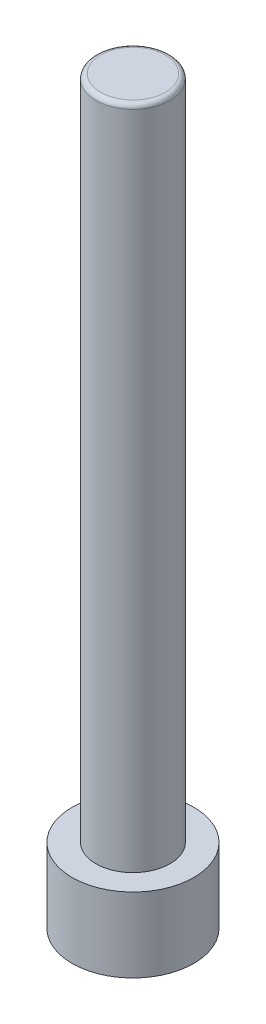
ISO-10303-21;
HEADER;
FILE_DESCRIPTION(('STEP AP214'),'2;1');
FILE_NAME('part.step','',(''),(''),'','','');
FILE_SCHEMA(('AUTOMOTIVE_DESIGN { 1 0 10303 214 1 1 1 1 }'));
ENDSEC;
DATA;
#1=APPLICATION_CONTEXT('core data for automotive mechanical design processes');
#2=APPLICATION_PROTOCOL_DEFINITION('international standard','automotive_design',2000,#1);
#3=PRODUCT_CONTEXT('',#1,'mechanical');
#4=PRODUCT('Part','Part','',(#3));
#5=PRODUCT_RELATED_PRODUCT_CATEGORY('part','',(#4));
#6=PRODUCT_DEFINITION_FORMATION('','',#4);
#7=PRODUCT_DEFINITION_CONTEXT('part definition',#1,'design');
#8=PRODUCT_DEFINITION('design','',#6,#7);
#9=PRODUCT_DEFINITION_SHAPE('','',#8);
#10=(LENGTH_UNIT() NAMED_UNIT(*) SI_UNIT(.MILLI.,.METRE.));
#11=(NAMED_UNIT(*) PLANE_ANGLE_UNIT() SI_UNIT($,.RADIAN.));
#12=(NAMED_UNIT(*) SI_UNIT($,.STERADIAN.) SOLID_ANGLE_UNIT());
#13=UNCERTAINTY_MEASURE_WITH_UNIT(LENGTH_MEASURE(1.E-05),#10,'distance_accuracy_value','');
#14=(GEOMETRIC_REPRESENTATION_CONTEXT(3) GLOBAL_UNCERTAINTY_ASSIGNED_CONTEXT((#13)) GLOBAL_UNIT_ASSIGNED_CONTEXT((#10,
#11,#12)) REPRESENTATION_CONTEXT('',''));
#15=CARTESIAN_POINT('',(0.,0.,0.));
#16=DIRECTION('',(0.,0.,1.));
#17=DIRECTION('',(1.,0.,0.));
#18=AXIS2_PLACEMENT_3D('',#15,#16,#17);
#19=CARTESIAN_POINT('',(0.,77.83,0.));
#20=DIRECTION('',(0.,-1.,0.));
#21=DIRECTION('',(0.,0.,-1.));
#22=AXIS2_PLACEMENT_3D('',#19,#20,#21);
#23=CYLINDRICAL_SURFACE('',#22,6.4);
#24=CARTESIAN_POINT('',(0.,0.,0.));
#25=DIRECTION('',(0.,1.,0.));
#26=DIRECTION('',(0.,0.,1.));
#27=AXIS2_PLACEMENT_3D('',#24,#25,#26);
#28=CIRCLE('',#27,6.4);
#29=CARTESIAN_POINT('',(0.,0.,6.4));
#30=VERTEX_POINT('',#29);
#31=EDGE_CURVE('E147',#30,#30,#28,.T.);
#32=ORIENTED_EDGE('',*,*,#31,.T.);
#33=EDGE_LOOP('',(#32));
#34=FACE_BOUND('',#33,.T.);
#35=CARTESIAN_POINT('',(0.,7.82999999999999,0.));
#36=DIRECTION('',(0.,1.,0.));
#37=DIRECTION('',(0.,0.,1.));
#38=AXIS2_PLACEMENT_3D('',#35,#36,#37);
#39=CIRCLE('',#38,6.4);
#40=CARTESIAN_POINT('',(0.,7.82999999999999,6.4));
#41=VERTEX_POINT('',#40);
#42=EDGE_CURVE('E146',#41,#41,#39,.T.);
#43=ORIENTED_EDGE('',*,*,#42,.F.);
#44=EDGE_LOOP('',(#43));
#45=FACE_BOUND('',#44,.T.);
#46=ADVANCED_FACE('F36',(#34,#45),#23,.T.);
#47=CARTESIAN_POINT('',(0.,0.,0.));
#48=DIRECTION('',(0.,1.,0.));
#49=DIRECTION('',(0.,0.,1.));
#50=AXIS2_PLACEMENT_3D('',#47,#48,#49);
#51=PLANE('',#50);
#52=DIRECTION('',(-0.5,0.,0.866025403784438));
#53=VECTOR('',#52,1.);
#54=CARTESIAN_POINT('',(3.46410161513775,0.,0.));
#55=LINE('',#54,#53);
#56=CARTESIAN_POINT('',(3.46410161513776,0.,0.));
#57=VERTEX_POINT('',#56);
#58=CARTESIAN_POINT('',(1.73205080756888,0.,3.));
#59=VERTEX_POINT('',#58);
#60=EDGE_CURVE('E125',#57,#59,#55,.T.);
#61=ORIENTED_EDGE('',*,*,#60,.F.);
#62=DIRECTION('',(0.5,0.,0.866025403784439));
#63=VECTOR('',#62,1.);
#64=CARTESIAN_POINT('',(1.73205080756888,0.,-3.));
#65=LINE('',#64,#63);
#66=CARTESIAN_POINT('',(1.73205080756888,0.,-3.));
#67=VERTEX_POINT('',#66);
#68=EDGE_CURVE('E51',#67,#57,#65,.T.);
#69=ORIENTED_EDGE('',*,*,#68,.F.);
#70=DIRECTION('',(1.,0.,0.));
#71=VECTOR('',#70,1.);
#72=CARTESIAN_POINT('',(-1.73205080756888,0.,-3.));
#73=LINE('',#72,#71);
#74=CARTESIAN_POINT('',(-1.73205080756888,0.,-3.));
#75=VERTEX_POINT('',#74);
#76=EDGE_CURVE('E134',#75,#67,#73,.T.);
#77=ORIENTED_EDGE('',*,*,#76,.F.);
#78=DIRECTION('',(0.5,0.,-0.866025403784439));
#79=VECTOR('',#78,1.);
#80=CARTESIAN_POINT('',(-3.46410161513775,0.,0.));
#81=LINE('',#80,#79);
#82=CARTESIAN_POINT('',(-3.46410161513775,0.,0.));
#83=VERTEX_POINT('',#82);
#84=EDGE_CURVE('E132',#83,#75,#81,.T.);
#85=ORIENTED_EDGE('',*,*,#84,.F.);
#86=DIRECTION('',(-0.5,0.,-0.866025403784439));
#87=VECTOR('',#86,1.);
#88=CARTESIAN_POINT('',(-1.73205080756888,0.,3.));
#89=LINE('',#88,#87);
#90=CARTESIAN_POINT('',(-1.73205080756888,0.,3.));
#91=VERTEX_POINT('',#90);
#92=EDGE_CURVE('E99',#91,#83,#89,.T.);
#93=ORIENTED_EDGE('',*,*,#92,.F.);
#94=DIRECTION('',(-1.,0.,0.));
#95=VECTOR('',#94,1.);
#96=CARTESIAN_POINT('',(1.73205080756888,0.,3.));
#97=LINE('',#96,#95);
#98=EDGE_CURVE('E128',#59,#91,#97,.T.);
#99=ORIENTED_EDGE('',*,*,#98,.F.);
#100=EDGE_LOOP('',(#61,#69,#77,#85,#93,#99));
#101=FACE_BOUND('',#100,.T.);
#102=ORIENTED_EDGE('',*,*,#31,.F.);
#103=EDGE_LOOP('',(#102));
#104=FACE_BOUND('',#103,.T.);
#105=ADVANCED_FACE('F165',(#101,#104),#51,.F.);
#106=CARTESIAN_POINT('',(0.,7.82999999999999,0.));
#107=DIRECTION('',(0.,1.,0.));
#108=DIRECTION('',(0.,0.,1.));
#109=AXIS2_PLACEMENT_3D('',#106,#107,#108);
#110=PLANE('',#109);
#111=CARTESIAN_POINT('',(0.,7.82999999999999,0.));
#112=DIRECTION('',(0.,1.,0.));
#113=DIRECTION('',(0.,0.,1.));
#114=AXIS2_PLACEMENT_3D('',#111,#112,#113);
#115=CIRCLE('',#114,3.9);
#116=CARTESIAN_POINT('',(0.,7.82999999999999,3.9));
#117=VERTEX_POINT('',#116);
#118=EDGE_CURVE('E138',#117,#117,#115,.T.);
#119=ORIENTED_EDGE('',*,*,#118,.F.);
#120=EDGE_LOOP('',(#119));
#121=FACE_BOUND('',#120,.T.);
#122=ORIENTED_EDGE('',*,*,#42,.T.);
#123=EDGE_LOOP('',(#122));
#124=FACE_BOUND('',#123,.T.);
#125=ADVANCED_FACE('F170',(#121,#124),#110,.T.);
#126=CARTESIAN_POINT('',(0.,7.82999999999999,0.));
#127=DIRECTION('',(0.,1.,0.));
#128=DIRECTION('',(0.,0.,1.));
#129=AXIS2_PLACEMENT_3D('',#126,#127,#128);
#130=CYLINDRICAL_SURFACE('',#129,3.9);
#131=CARTESIAN_POINT('',(0.,77.33,0.));
#132=DIRECTION('',(0.,1.,0.));
#133=DIRECTION('',(0.,0.,1.));
#134=AXIS2_PLACEMENT_3D('',#131,#132,#133);
#135=CIRCLE('',#134,3.9);
#136=CARTESIAN_POINT('',(0.,77.33,3.9));
#137=VERTEX_POINT('',#136);
#138=EDGE_CURVE('E12',#137,#137,#135,.F.);
#139=ORIENTED_EDGE('',*,*,#138,.T.);
#140=EDGE_LOOP('',(#139));
#141=FACE_BOUND('',#140,.T.);
#142=ORIENTED_EDGE('',*,*,#118,.T.);
#143=EDGE_LOOP('',(#142));
#144=FACE_BOUND('',#143,.T.);
#145=ADVANCED_FACE('F178',(#141,#144),#130,.T.);
#146=CARTESIAN_POINT('',(0.,77.83,0.));
#147=DIRECTION('',(0.,1.,0.));
#148=DIRECTION('',(0.,0.,1.));
#149=AXIS2_PLACEMENT_3D('',#146,#147,#148);
#150=PLANE('',#149);
#151=CARTESIAN_POINT('',(0.,77.83,0.));
#152=DIRECTION('',(0.,1.,0.));
#153=DIRECTION('',(0.,0.,1.));
#154=AXIS2_PLACEMENT_3D('',#151,#152,#153);
#155=CIRCLE('',#154,3.4);
#156=CARTESIAN_POINT('',(0.,77.83,3.4));
#157=VERTEX_POINT('',#156);
#158=EDGE_CURVE('E44',#157,#157,#155,.T.);
#159=ORIENTED_EDGE('',*,*,#158,.T.);
#160=EDGE_LOOP('',(#159));
#161=FACE_BOUND('',#160,.T.);
#162=ADVANCED_FACE('F154',(#161),#150,.T.);
#163=CARTESIAN_POINT('',(1.73205080756888,5.64,-3.));
#164=DIRECTION('',(0.866025403784439,0.,-0.5));
#165=DIRECTION('',(-0.5,0.,-0.866025403784439));
#166=AXIS2_PLACEMENT_3D('',#163,#164,#165);
#167=PLANE('',#166);
#168=ORIENTED_EDGE('',*,*,#68,.T.);
#169=DIRECTION('',(0.,-1.,0.));
#170=VECTOR('',#169,1.);
#171=CARTESIAN_POINT('',(3.46410161513775,5.64,0.));
#172=LINE('',#171,#170);
#173=CARTESIAN_POINT('',(3.46410161513775,5.64,0.));
#174=VERTEX_POINT('',#173);
#175=EDGE_CURVE('E81',#174,#57,#172,.T.);
#176=ORIENTED_EDGE('',*,*,#175,.F.);
#177=DIRECTION('',(0.5,0.,0.866025403784439));
#178=VECTOR('',#177,1.);
#179=CARTESIAN_POINT('',(1.73205080756888,5.64,-3.));
#180=LINE('',#179,#178);
#181=CARTESIAN_POINT('',(1.73205080756888,5.64,-3.));
#182=VERTEX_POINT('',#181);
#183=EDGE_CURVE('E136',#182,#174,#180,.T.);
#184=ORIENTED_EDGE('',*,*,#183,.F.);
#185=DIRECTION('',(0.,-1.,0.));
#186=VECTOR('',#185,1.);
#187=CARTESIAN_POINT('',(1.73205080756888,5.64,-3.));
#188=LINE('',#187,#186);
#189=EDGE_CURVE('E59',#182,#67,#188,.T.);
#190=ORIENTED_EDGE('',*,*,#189,.T.);
#191=EDGE_LOOP('',(#168,#176,#184,#190));
#192=FACE_BOUND('',#191,.T.);
#193=ADVANCED_FACE('F177',(#192),#167,.F.);
#194=CARTESIAN_POINT('',(-1.73205080756888,5.64,-3.));
#195=DIRECTION('',(0.,0.,-1.));
#196=DIRECTION('',(-1.,0.,0.));
#197=AXIS2_PLACEMENT_3D('',#194,#195,#196);
#198=PLANE('',#197);
#199=ORIENTED_EDGE('',*,*,#76,.T.);
#200=ORIENTED_EDGE('',*,*,#189,.F.);
#201=DIRECTION('',(1.,0.,0.));
#202=VECTOR('',#201,1.);
#203=CARTESIAN_POINT('',(-1.73205080756888,5.64,-3.));
#204=LINE('',#203,#202);
#205=CARTESIAN_POINT('',(-1.73205080756888,5.64,-3.));
#206=VERTEX_POINT('',#205);
#207=EDGE_CURVE('E111',#206,#182,#204,.T.);
#208=ORIENTED_EDGE('',*,*,#207,.F.);
#209=DIRECTION('',(0.,-1.,0.));
#210=VECTOR('',#209,1.);
#211=CARTESIAN_POINT('',(-1.73205080756888,5.64,-3.));
#212=LINE('',#211,#210);
#213=EDGE_CURVE('E103',#206,#75,#212,.T.);
#214=ORIENTED_EDGE('',*,*,#213,.T.);
#215=EDGE_LOOP('',(#199,#200,#208,#214));
#216=FACE_BOUND('',#215,.T.);
#217=ADVANCED_FACE('F187',(#216),#198,.F.);
#218=CARTESIAN_POINT('',(-3.46410161513775,5.64,0.));
#219=DIRECTION('',(-0.866025403784439,0.,-0.5));
#220=DIRECTION('',(-0.5,0.,0.866025403784439));
#221=AXIS2_PLACEMENT_3D('',#218,#219,#220);
#222=PLANE('',#221);
#223=ORIENTED_EDGE('',*,*,#84,.T.);
#224=ORIENTED_EDGE('',*,*,#213,.F.);
#225=DIRECTION('',(0.5,0.,-0.866025403784439));
#226=VECTOR('',#225,1.);
#227=CARTESIAN_POINT('',(-3.46410161513775,5.64,0.));
#228=LINE('',#227,#226);
#229=CARTESIAN_POINT('',(-3.46410161513775,5.64,0.));
#230=VERTEX_POINT('',#229);
#231=EDGE_CURVE('E107',#230,#206,#228,.T.);
#232=ORIENTED_EDGE('',*,*,#231,.F.);
#233=DIRECTION('',(0.,-1.,0.));
#234=VECTOR('',#233,1.);
#235=CARTESIAN_POINT('',(-3.46410161513775,5.64,0.));
#236=LINE('',#235,#234);
#237=EDGE_CURVE('E92',#230,#83,#236,.T.);
#238=ORIENTED_EDGE('',*,*,#237,.T.);
#239=EDGE_LOOP('',(#223,#224,#232,#238));
#240=FACE_BOUND('',#239,.T.);
#241=ADVANCED_FACE('F108',(#240),#222,.F.);
#242=CARTESIAN_POINT('',(-1.73205080756888,5.64,3.));
#243=DIRECTION('',(-0.866025403784439,0.,0.5));
#244=DIRECTION('',(0.5,0.,0.866025403784439));
#245=AXIS2_PLACEMENT_3D('',#242,#243,#244);
#246=PLANE('',#245);
#247=ORIENTED_EDGE('',*,*,#92,.T.);
#248=ORIENTED_EDGE('',*,*,#237,.F.);
#249=DIRECTION('',(-0.5,0.,-0.866025403784439));
#250=VECTOR('',#249,1.);
#251=CARTESIAN_POINT('',(-1.73205080756888,5.64,3.));
#252=LINE('',#251,#250);
#253=CARTESIAN_POINT('',(-1.73205080756888,5.64,3.));
#254=VERTEX_POINT('',#253);
#255=EDGE_CURVE('E96',#254,#230,#252,.T.);
#256=ORIENTED_EDGE('',*,*,#255,.F.);
#257=DIRECTION('',(0.,-1.,0.));
#258=VECTOR('',#257,1.);
#259=CARTESIAN_POINT('',(-1.73205080756888,5.64,3.));
#260=LINE('',#259,#258);
#261=EDGE_CURVE('E104',#254,#91,#260,.T.);
#262=ORIENTED_EDGE('',*,*,#261,.T.);
#263=EDGE_LOOP('',(#247,#248,#256,#262));
#264=FACE_BOUND('',#263,.T.);
#265=ADVANCED_FACE('F94',(#264),#246,.F.);
#266=CARTESIAN_POINT('',(1.73205080756888,5.64,3.));
#267=DIRECTION('',(0.,0.,1.));
#268=DIRECTION('',(1.,0.,0.));
#269=AXIS2_PLACEMENT_3D('',#266,#267,#268);
#270=PLANE('',#269);
#271=ORIENTED_EDGE('',*,*,#98,.T.);
#272=ORIENTED_EDGE('',*,*,#261,.F.);
#273=DIRECTION('',(-1.,0.,0.));
#274=VECTOR('',#273,1.);
#275=CARTESIAN_POINT('',(1.73205080756888,5.64,3.));
#276=LINE('',#275,#274);
#277=CARTESIAN_POINT('',(1.73205080756888,5.64,3.));
#278=VERTEX_POINT('',#277);
#279=EDGE_CURVE('E117',#278,#254,#276,.T.);
#280=ORIENTED_EDGE('',*,*,#279,.F.);
#281=DIRECTION('',(0.,-1.,0.));
#282=VECTOR('',#281,1.);
#283=CARTESIAN_POINT('',(1.73205080756888,5.64,3.));
#284=LINE('',#283,#282);
#285=EDGE_CURVE('E141',#278,#59,#284,.T.);
#286=ORIENTED_EDGE('',*,*,#285,.T.);
#287=EDGE_LOOP('',(#271,#272,#280,#286));
#288=FACE_BOUND('',#287,.T.);
#289=ADVANCED_FACE('F190',(#288),#270,.F.);
#290=CARTESIAN_POINT('',(3.46410161513775,5.64,0.));
#291=DIRECTION('',(0.866025403784439,0.,0.5));
#292=DIRECTION('',(0.5,0.,-0.866025403784439));
#293=AXIS2_PLACEMENT_3D('',#290,#291,#292);
#294=PLANE('',#293);
#295=ORIENTED_EDGE('',*,*,#60,.T.);
#296=ORIENTED_EDGE('',*,*,#285,.F.);
#297=DIRECTION('',(-0.5,0.,0.866025403784438));
#298=VECTOR('',#297,1.);
#299=CARTESIAN_POINT('',(3.46410161513775,5.64,0.));
#300=LINE('',#299,#298);
#301=EDGE_CURVE('E119',#174,#278,#300,.T.);
#302=ORIENTED_EDGE('',*,*,#301,.F.);
#303=ORIENTED_EDGE('',*,*,#175,.T.);
#304=EDGE_LOOP('',(#295,#296,#302,#303));
#305=FACE_BOUND('',#304,.T.);
#306=ADVANCED_FACE('F161',(#305),#294,.F.);
#307=CARTESIAN_POINT('',(0.,5.64,0.));
#308=DIRECTION('',(0.,-1.,0.));
#309=DIRECTION('',(0.,0.,-1.));
#310=AXIS2_PLACEMENT_3D('',#307,#308,#309);
#311=PLANE('',#310);
#312=ORIENTED_EDGE('',*,*,#183,.T.);
#313=ORIENTED_EDGE('',*,*,#301,.T.);
#314=ORIENTED_EDGE('',*,*,#279,.T.);
#315=ORIENTED_EDGE('',*,*,#255,.T.);
#316=ORIENTED_EDGE('',*,*,#231,.T.);
#317=ORIENTED_EDGE('',*,*,#207,.T.);
#318=EDGE_LOOP('',(#312,#313,#314,#315,#316,#317));
#319=FACE_BOUND('',#318,.T.);
#320=ADVANCED_FACE('F114',(#319),#311,.T.);
#321=CARTESIAN_POINT('',(0.,77.33,0.));
#322=DIRECTION('',(0.,1.,0.));
#323=DIRECTION('',(0.,0.,1.));
#324=AXIS2_PLACEMENT_3D('',#321,#322,#323);
#325=TOROIDAL_SURFACE('',#324,3.4,0.5);
#326=ORIENTED_EDGE('',*,*,#138,.F.);
#327=EDGE_LOOP('',(#326));
#328=FACE_BOUND('',#327,.T.);
#329=ORIENTED_EDGE('',*,*,#158,.F.);
#330=EDGE_LOOP('',(#329));
#331=FACE_BOUND('',#330,.T.);
#332=ADVANCED_FACE('F38',(#328,#331),#325,.T.);
#333=CLOSED_SHELL('',(#46,#105,#125,#145,#162,#193,#217,#241,#265,#289,#306,#320,#332));
#334=MANIFOLD_SOLID_BREP('B2',#333);
#335=ADVANCED_BREP_SHAPE_REPRESENTATION('',(#18,#334),#14);
#336=SHAPE_DEFINITION_REPRESENTATION(#9,#335);
ENDSEC;
END-ISO-10303-21;
